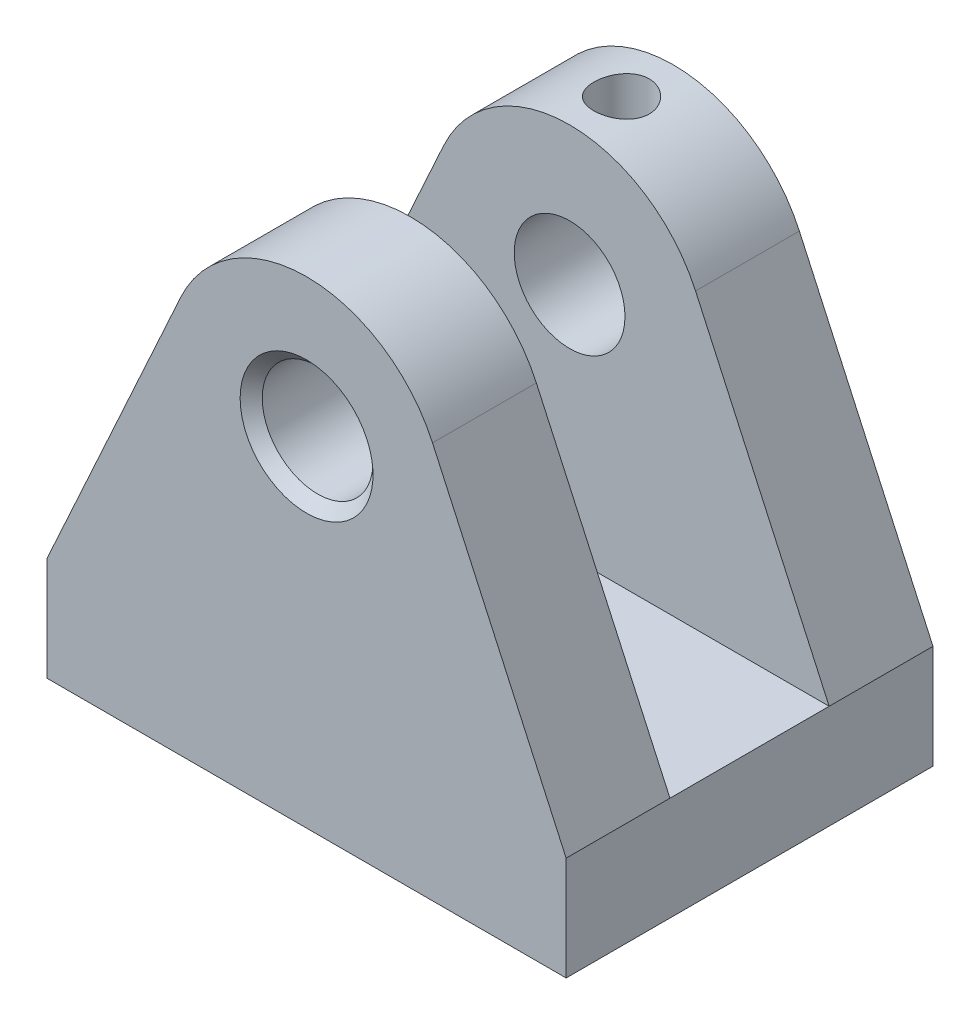
ISO-10303-21;
HEADER;
FILE_DESCRIPTION(('STEP AP214'),'2;1');
FILE_NAME('part.step','',(''),(''),'','','');
FILE_SCHEMA(('AUTOMOTIVE_DESIGN { 1 0 10303 214 1 1 1 1 }'));
ENDSEC;
DATA;
#1=APPLICATION_CONTEXT('core data for automotive mechanical design processes');
#2=APPLICATION_PROTOCOL_DEFINITION('international standard','automotive_design',2000,#1);
#3=PRODUCT_CONTEXT('',#1,'mechanical');
#4=PRODUCT('Part','Part','',(#3));
#5=PRODUCT_RELATED_PRODUCT_CATEGORY('part','',(#4));
#6=PRODUCT_DEFINITION_FORMATION('','',#4);
#7=PRODUCT_DEFINITION_CONTEXT('part definition',#1,'design');
#8=PRODUCT_DEFINITION('design','',#6,#7);
#9=PRODUCT_DEFINITION_SHAPE('','',#8);
#10=(LENGTH_UNIT() NAMED_UNIT(*) SI_UNIT(.MILLI.,.METRE.));
#11=(NAMED_UNIT(*) PLANE_ANGLE_UNIT() SI_UNIT($,.RADIAN.));
#12=(NAMED_UNIT(*) SI_UNIT($,.STERADIAN.) SOLID_ANGLE_UNIT());
#13=UNCERTAINTY_MEASURE_WITH_UNIT(LENGTH_MEASURE(1.E-05),#10,'distance_accuracy_value','');
#14=(GEOMETRIC_REPRESENTATION_CONTEXT(3) GLOBAL_UNCERTAINTY_ASSIGNED_CONTEXT((#13)) GLOBAL_UNIT_ASSIGNED_CONTEXT((#10,
#11,#12)) REPRESENTATION_CONTEXT('',''));
#15=CARTESIAN_POINT('',(0.,0.,0.));
#16=DIRECTION('',(0.,0.,1.));
#17=DIRECTION('',(1.,0.,0.));
#18=AXIS2_PLACEMENT_3D('',#15,#16,#17);
#19=CARTESIAN_POINT('',(-37.5,0.,15.));
#20=DIRECTION('',(-1.,0.,0.));
#21=DIRECTION('',(0.,0.,1.));
#22=AXIS2_PLACEMENT_3D('',#19,#20,#21);
#23=PLANE('',#22);
#24=DIRECTION('',(0.,0.,-1.));
#25=VECTOR('',#24,1.);
#26=CARTESIAN_POINT('',(-37.5,14.9969937199859,15.));
#27=LINE('',#26,#25);
#28=CARTESIAN_POINT('',(-37.5,14.9969937199859,15.));
#29=VERTEX_POINT('',#28);
#30=CARTESIAN_POINT('',(-37.5,14.9969937199859,0.));
#31=VERTEX_POINT('',#30);
#32=EDGE_CURVE('E96',#29,#31,#27,.T.);
#33=ORIENTED_EDGE('',*,*,#32,.T.);
#34=DIRECTION('',(0.,0.,1.));
#35=VECTOR('',#34,1.);
#36=CARTESIAN_POINT('',(-37.5,14.9969937199859,-11.5));
#37=LINE('',#36,#35);
#38=CARTESIAN_POINT('',(-37.5,14.9969937199859,-23.));
#39=VERTEX_POINT('',#38);
#40=EDGE_CURVE('E319',#39,#31,#37,.T.);
#41=ORIENTED_EDGE('',*,*,#40,.F.);
#42=DIRECTION('',(0.,0.,1.));
#43=VECTOR('',#42,1.);
#44=CARTESIAN_POINT('',(-37.5,14.9969937199859,-38.));
#45=LINE('',#44,#43);
#46=CARTESIAN_POINT('',(-37.5,14.9969937199859,-38.));
#47=VERTEX_POINT('',#46);
#48=EDGE_CURVE('E328',#47,#39,#45,.T.);
#49=ORIENTED_EDGE('',*,*,#48,.F.);
#50=DIRECTION('',(0.,1.,0.));
#51=VECTOR('',#50,1.);
#52=CARTESIAN_POINT('',(-37.5,0.,-38.));
#53=LINE('',#52,#51);
#54=CARTESIAN_POINT('',(-37.5,0.,-38.));
#55=VERTEX_POINT('',#54);
#56=EDGE_CURVE('E309',#55,#47,#53,.T.);
#57=ORIENTED_EDGE('',*,*,#56,.F.);
#58=DIRECTION('',(0.,0.,-1.));
#59=VECTOR('',#58,1.);
#60=CARTESIAN_POINT('',(-37.5,0.,15.));
#61=LINE('',#60,#59);
#62=CARTESIAN_POINT('',(-37.5,0.,15.));
#63=VERTEX_POINT('',#62);
#64=EDGE_CURVE('E67',#63,#55,#61,.T.);
#65=ORIENTED_EDGE('',*,*,#64,.F.);
#66=DIRECTION('',(0.,1.,0.));
#67=VECTOR('',#66,1.);
#68=CARTESIAN_POINT('',(-37.5,0.,15.));
#69=LINE('',#68,#67);
#70=EDGE_CURVE('E154',#63,#29,#69,.T.);
#71=ORIENTED_EDGE('',*,*,#70,.T.);
#72=EDGE_LOOP('',(#33,#41,#49,#57,#65,#71));
#73=FACE_BOUND('',#72,.T.);
#74=ADVANCED_FACE('F48',(#73),#23,.T.);
#75=CARTESIAN_POINT('',(-37.5,0.,15.));
#76=DIRECTION('',(0.,1.,0.));
#77=DIRECTION('',(-1.,0.,0.));
#78=AXIS2_PLACEMENT_3D('',#75,#76,#77);
#79=PLANE('',#78);
#80=ORIENTED_EDGE('',*,*,#64,.T.);
#81=DIRECTION('',(1.,0.,0.));
#82=VECTOR('',#81,1.);
#83=CARTESIAN_POINT('',(-37.5,0.,-38.));
#84=LINE('',#83,#82);
#85=CARTESIAN_POINT('',(37.5,0.,-38.));
#86=VERTEX_POINT('',#85);
#87=EDGE_CURVE('E330',#55,#86,#84,.T.);
#88=ORIENTED_EDGE('',*,*,#87,.T.);
#89=DIRECTION('',(0.,0.,-1.));
#90=VECTOR('',#89,1.);
#91=CARTESIAN_POINT('',(37.5,0.,15.));
#92=LINE('',#91,#90);
#93=CARTESIAN_POINT('',(37.5,0.,15.));
#94=VERTEX_POINT('',#93);
#95=EDGE_CURVE('E130',#94,#86,#92,.T.);
#96=ORIENTED_EDGE('',*,*,#95,.F.);
#97=DIRECTION('',(1.,0.,0.));
#98=VECTOR('',#97,1.);
#99=CARTESIAN_POINT('',(-37.5,0.,15.));
#100=LINE('',#99,#98);
#101=EDGE_CURVE('E114',#63,#94,#100,.T.);
#102=ORIENTED_EDGE('',*,*,#101,.F.);
#103=EDGE_LOOP('',(#80,#88,#96,#102));
#104=FACE_BOUND('',#103,.T.);
#105=ADVANCED_FACE('F195',(#104),#79,.F.);
#106=CARTESIAN_POINT('',(37.5,0.,15.));
#107=DIRECTION('',(-1.,0.,0.));
#108=DIRECTION('',(0.,-1.,0.));
#109=AXIS2_PLACEMENT_3D('',#106,#107,#108);
#110=PLANE('',#109);
#111=ORIENTED_EDGE('',*,*,#95,.T.);
#112=DIRECTION('',(0.,1.,0.));
#113=VECTOR('',#112,1.);
#114=CARTESIAN_POINT('',(37.5,0.,-38.));
#115=LINE('',#114,#113);
#116=CARTESIAN_POINT('',(37.5,14.9969937199858,-38.));
#117=VERTEX_POINT('',#116);
#118=EDGE_CURVE('E313',#86,#117,#115,.T.);
#119=ORIENTED_EDGE('',*,*,#118,.T.);
#120=DIRECTION('',(0.,0.,1.));
#121=VECTOR('',#120,1.);
#122=CARTESIAN_POINT('',(37.5,14.9969937199858,-38.));
#123=LINE('',#122,#121);
#124=CARTESIAN_POINT('',(37.5,14.9969937199858,-23.));
#125=VERTEX_POINT('',#124);
#126=EDGE_CURVE('E304',#117,#125,#123,.T.);
#127=ORIENTED_EDGE('',*,*,#126,.T.);
#128=DIRECTION('',(0.,0.,1.));
#129=VECTOR('',#128,1.);
#130=CARTESIAN_POINT('',(37.5,14.9969937199858,-11.5));
#131=LINE('',#130,#129);
#132=CARTESIAN_POINT('',(37.5,14.9969937199858,0.));
#133=VERTEX_POINT('',#132);
#134=EDGE_CURVE('E126',#125,#133,#131,.T.);
#135=ORIENTED_EDGE('',*,*,#134,.T.);
#136=DIRECTION('',(0.,0.,-1.));
#137=VECTOR('',#136,1.);
#138=CARTESIAN_POINT('',(37.5,14.9969937199858,15.));
#139=LINE('',#138,#137);
#140=CARTESIAN_POINT('',(37.5,14.9969937199858,15.));
#141=VERTEX_POINT('',#140);
#142=EDGE_CURVE('E122',#141,#133,#139,.T.);
#143=ORIENTED_EDGE('',*,*,#142,.F.);
#144=DIRECTION('',(0.,1.,0.));
#145=VECTOR('',#144,1.);
#146=CARTESIAN_POINT('',(37.5,0.,15.));
#147=LINE('',#146,#145);
#148=EDGE_CURVE('E107',#94,#141,#147,.T.);
#149=ORIENTED_EDGE('',*,*,#148,.F.);
#150=EDGE_LOOP('',(#111,#119,#127,#135,#143,#149));
#151=FACE_BOUND('',#150,.T.);
#152=ADVANCED_FACE('F123',(#151),#110,.F.);
#153=CARTESIAN_POINT('',(37.5,14.9969937199858,15.));
#154=DIRECTION('',(-0.909747292418773,-0.415162454873646,0.));
#155=DIRECTION('',(0.415162454873646,-0.909747292418773,0.));
#156=AXIS2_PLACEMENT_3D('',#153,#154,#155);
#157=PLANE('',#156);
#158=DIRECTION('',(-0.415162454873646,0.909747292418773,0.));
#159=VECTOR('',#158,1.);
#160=CARTESIAN_POINT('',(37.5,14.9969937199858,0.));
#161=LINE('',#160,#159);
#162=CARTESIAN_POINT('',(18.1949458483755,57.3002428174588,0.));
#163=VERTEX_POINT('',#162);
#164=EDGE_CURVE('E151',#133,#163,#161,.T.);
#165=ORIENTED_EDGE('',*,*,#164,.T.);
#166=DIRECTION('',(0.,0.,-1.));
#167=VECTOR('',#166,1.);
#168=CARTESIAN_POINT('',(18.1949458483755,57.3002428174588,15.));
#169=LINE('',#168,#167);
#170=CARTESIAN_POINT('',(18.1949458483755,57.3002428174588,15.));
#171=VERTEX_POINT('',#170);
#172=EDGE_CURVE('E90',#171,#163,#169,.T.);
#173=ORIENTED_EDGE('',*,*,#172,.F.);
#174=DIRECTION('',(-0.415162454873646,0.909747292418773,0.));
#175=VECTOR('',#174,1.);
#176=CARTESIAN_POINT('',(37.5,14.9969937199858,15.));
#177=LINE('',#176,#175);
#178=EDGE_CURVE('E113',#141,#171,#177,.T.);
#179=ORIENTED_EDGE('',*,*,#178,.F.);
#180=ORIENTED_EDGE('',*,*,#142,.T.);
#181=EDGE_LOOP('',(#165,#173,#179,#180));
#182=FACE_BOUND('',#181,.T.);
#183=ADVANCED_FACE('F132',(#182),#157,.F.);
#184=CARTESIAN_POINT('',(0.,48.9969937199859,15.));
#185=DIRECTION('',(0.,0.,-1.));
#186=DIRECTION('',(-1.,0.,0.));
#187=AXIS2_PLACEMENT_3D('',#184,#185,#186);
#188=CYLINDRICAL_SURFACE('',#187,20.);
#189=CARTESIAN_POINT('',(0.,48.9969937199859,0.));
#190=DIRECTION('',(0.,0.,-1.));
#191=DIRECTION('',(-1.,0.,0.));
#192=AXIS2_PLACEMENT_3D('',#189,#190,#191);
#193=CIRCLE('',#192,20.);
#194=CARTESIAN_POINT('',(-18.1949458483755,57.3002428174588,0.));
#195=VERTEX_POINT('',#194);
#196=EDGE_CURVE('E147',#195,#163,#193,.T.);
#197=ORIENTED_EDGE('',*,*,#196,.F.);
#198=DIRECTION('',(0.,0.,-1.));
#199=VECTOR('',#198,1.);
#200=CARTESIAN_POINT('',(-18.1949458483755,57.3002428174588,15.));
#201=LINE('',#200,#199);
#202=CARTESIAN_POINT('',(-18.1949458483755,57.3002428174588,15.));
#203=VERTEX_POINT('',#202);
#204=EDGE_CURVE('E83',#203,#195,#201,.T.);
#205=ORIENTED_EDGE('',*,*,#204,.F.);
#206=CARTESIAN_POINT('',(0.,48.9969937199859,15.));
#207=DIRECTION('',(0.,0.,-1.));
#208=DIRECTION('',(-1.,0.,0.));
#209=AXIS2_PLACEMENT_3D('',#206,#207,#208);
#210=CIRCLE('',#209,20.);
#211=EDGE_CURVE('E134',#203,#171,#210,.T.);
#212=ORIENTED_EDGE('',*,*,#211,.T.);
#213=ORIENTED_EDGE('',*,*,#172,.T.);
#214=EDGE_LOOP('',(#197,#205,#212,#213));
#215=FACE_BOUND('',#214,.T.);
#216=ADVANCED_FACE('F211',(#215),#188,.T.);
#217=CARTESIAN_POINT('',(-37.5,14.9969937199859,15.));
#218=DIRECTION('',(-0.909747292418773,0.415162454873646,0.));
#219=DIRECTION('',(-0.415162454873646,-0.909747292418773,0.));
#220=AXIS2_PLACEMENT_3D('',#217,#218,#219);
#221=PLANE('',#220);
#222=DIRECTION('',(0.415162454873646,0.909747292418773,0.));
#223=VECTOR('',#222,1.);
#224=CARTESIAN_POINT('',(-37.5,14.9969937199859,0.));
#225=LINE('',#224,#223);
#226=EDGE_CURVE('E143',#31,#195,#225,.T.);
#227=ORIENTED_EDGE('',*,*,#226,.F.);
#228=ORIENTED_EDGE('',*,*,#32,.F.);
#229=DIRECTION('',(0.415162454873646,0.909747292418773,0.));
#230=VECTOR('',#229,1.);
#231=CARTESIAN_POINT('',(-37.5,14.9969937199859,15.));
#232=LINE('',#231,#230);
#233=EDGE_CURVE('E137',#29,#203,#232,.T.);
#234=ORIENTED_EDGE('',*,*,#233,.T.);
#235=ORIENTED_EDGE('',*,*,#204,.T.);
#236=EDGE_LOOP('',(#227,#228,#234,#235));
#237=FACE_BOUND('',#236,.T.);
#238=ADVANCED_FACE('F203',(#237),#221,.T.);
#239=CARTESIAN_POINT('',(0.,48.9969937199859,15.));
#240=DIRECTION('',(0.,0.,-1.));
#241=DIRECTION('',(-1.,0.,0.));
#242=AXIS2_PLACEMENT_3D('',#239,#240,#241);
#243=PLANE('',#242);
#244=CARTESIAN_POINT('',(0.,49.,15.));
#245=DIRECTION('',(0.,0.,-1.));
#246=DIRECTION('',(-1.,0.,0.));
#247=AXIS2_PLACEMENT_3D('',#244,#245,#246);
#248=CIRCLE('',#247,9.6);
#249=CARTESIAN_POINT('',(-9.6,49.,15.));
#250=VERTEX_POINT('',#249);
#251=EDGE_CURVE('E11',#250,#250,#248,.T.);
#252=ORIENTED_EDGE('',*,*,#251,.T.);
#253=EDGE_LOOP('',(#252));
#254=FACE_BOUND('',#253,.T.);
#255=ORIENTED_EDGE('',*,*,#70,.F.);
#256=ORIENTED_EDGE('',*,*,#101,.T.);
#257=ORIENTED_EDGE('',*,*,#148,.T.);
#258=ORIENTED_EDGE('',*,*,#178,.T.);
#259=ORIENTED_EDGE('',*,*,#211,.F.);
#260=ORIENTED_EDGE('',*,*,#233,.F.);
#261=EDGE_LOOP('',(#255,#256,#257,#258,#259,#260));
#262=FACE_BOUND('',#261,.T.);
#263=ADVANCED_FACE('F110',(#254,#262),#243,.F.);
#264=CARTESIAN_POINT('',(0.,48.9969937199859,0.));
#265=DIRECTION('',(0.,0.,-1.));
#266=DIRECTION('',(-1.,0.,0.));
#267=AXIS2_PLACEMENT_3D('',#264,#265,#266);
#268=PLANE('',#267);
#269=CARTESIAN_POINT('',(0.,49.,0.));
#270=DIRECTION('',(0.,0.,-1.));
#271=DIRECTION('',(-1.,0.,0.));
#272=AXIS2_PLACEMENT_3D('',#269,#270,#271);
#273=CIRCLE('',#272,8.);
#274=CARTESIAN_POINT('',(-8.,49.,0.));
#275=VERTEX_POINT('',#274);
#276=EDGE_CURVE('E170',#275,#275,#273,.T.);
#277=ORIENTED_EDGE('',*,*,#276,.F.);
#278=EDGE_LOOP('',(#277));
#279=FACE_BOUND('',#278,.T.);
#280=DIRECTION('',(1.,0.,0.));
#281=VECTOR('',#280,1.);
#282=CARTESIAN_POINT('',(-37.5,14.9969937199859,0.));
#283=LINE('',#282,#281);
#284=EDGE_CURVE('E315',#31,#133,#283,.T.);
#285=ORIENTED_EDGE('',*,*,#284,.F.);
#286=ORIENTED_EDGE('',*,*,#226,.T.);
#287=ORIENTED_EDGE('',*,*,#196,.T.);
#288=ORIENTED_EDGE('',*,*,#164,.F.);
#289=EDGE_LOOP('',(#285,#286,#287,#288));
#290=FACE_BOUND('',#289,.T.);
#291=ADVANCED_FACE('F218',(#279,#290),#268,.T.);
#292=CARTESIAN_POINT('',(-37.5,14.9969937199859,-11.5));
#293=DIRECTION('',(0.,-1.,0.));
#294=DIRECTION('',(1.,0.,0.));
#295=AXIS2_PLACEMENT_3D('',#292,#293,#294);
#296=PLANE('',#295);
#297=ORIENTED_EDGE('',*,*,#284,.T.);
#298=ORIENTED_EDGE('',*,*,#134,.F.);
#299=DIRECTION('',(1.,0.,0.));
#300=VECTOR('',#299,1.);
#301=CARTESIAN_POINT('',(-37.5,14.9969937199859,-23.));
#302=LINE('',#301,#300);
#303=EDGE_CURVE('E287',#39,#125,#302,.T.);
#304=ORIENTED_EDGE('',*,*,#303,.F.);
#305=ORIENTED_EDGE('',*,*,#40,.T.);
#306=EDGE_LOOP('',(#297,#298,#304,#305));
#307=FACE_BOUND('',#306,.T.);
#308=ADVANCED_FACE('F221',(#307),#296,.F.);
#309=CARTESIAN_POINT('',(37.5,14.9969937199858,-38.));
#310=DIRECTION('',(-0.909747292418773,-0.415162454873646,0.));
#311=DIRECTION('',(0.415162454873646,-0.909747292418773,0.));
#312=AXIS2_PLACEMENT_3D('',#309,#310,#311);
#313=PLANE('',#312);
#314=DIRECTION('',(-0.415162454873646,0.909747292418773,0.));
#315=VECTOR('',#314,1.);
#316=CARTESIAN_POINT('',(37.5,14.9969937199858,-23.));
#317=LINE('',#316,#315);
#318=CARTESIAN_POINT('',(18.1949458483755,57.3002428174588,-23.));
#319=VERTEX_POINT('',#318);
#320=EDGE_CURVE('E291',#125,#319,#317,.T.);
#321=ORIENTED_EDGE('',*,*,#320,.F.);
#322=ORIENTED_EDGE('',*,*,#126,.F.);
#323=DIRECTION('',(-0.415162454873646,0.909747292418773,0.));
#324=VECTOR('',#323,1.);
#325=CARTESIAN_POINT('',(37.5,14.9969937199858,-38.));
#326=LINE('',#325,#324);
#327=CARTESIAN_POINT('',(18.1949458483755,57.3002428174588,-38.));
#328=VERTEX_POINT('',#327);
#329=EDGE_CURVE('E368',#117,#328,#326,.T.);
#330=ORIENTED_EDGE('',*,*,#329,.T.);
#331=DIRECTION('',(0.,0.,1.));
#332=VECTOR('',#331,1.);
#333=CARTESIAN_POINT('',(18.1949458483755,57.3002428174588,-38.));
#334=LINE('',#333,#332);
#335=EDGE_CURVE('E307',#328,#319,#334,.T.);
#336=ORIENTED_EDGE('',*,*,#335,.T.);
#337=EDGE_LOOP('',(#321,#322,#330,#336));
#338=FACE_BOUND('',#337,.T.);
#339=ADVANCED_FACE('F228',(#338),#313,.F.);
#340=CARTESIAN_POINT('',(0.,48.9969937199859,-38.));
#341=DIRECTION('',(0.,0.,1.));
#342=DIRECTION('',(-1.,0.,0.));
#343=AXIS2_PLACEMENT_3D('',#340,#341,#342);
#344=CYLINDRICAL_SURFACE('',#343,20.);
#345=CARTESIAN_POINT('',(0.,68.9969937199859,-26.5));
#346=CARTESIAN_POINT('',(-0.222307627170533,68.9969896232207,-26.5000081779934));
#347=CARTESIAN_POINT('',(-0.444718640806089,68.9932491271151,-26.5185953718706));
#348=CARTESIAN_POINT('',(-0.883254030756077,68.9786883449151,-26.592394000461));
#349=CARTESIAN_POINT('',(-1.09937327016542,68.9678624343934,-26.647634531206));
#350=CARTESIAN_POINT('',(-1.51892122105325,68.9403396911172,-26.7929650944831));
#351=CARTESIAN_POINT('',(-1.72236187173253,68.9236484830542,-26.8830217473787));
#352=CARTESIAN_POINT('',(-2.1112319554569,68.8862096413988,-27.0953289900452));
#353=CARTESIAN_POINT('',(-2.29666246030325,68.8654622494157,-27.2175776624289));
#354=CARTESIAN_POINT('',(-2.64677390925946,68.8218803331831,-27.4925539771657));
#355=CARTESIAN_POINT('',(-2.81117580463408,68.7990235401539,-27.6456334215647));
#356=CARTESIAN_POINT('',(-3.11214702643213,68.7539609380952,-27.9771696655669));
#357=CARTESIAN_POINT('',(-3.24871417908175,68.7317551800245,-28.1556284453409));
#358=CARTESIAN_POINT('',(-3.49132701339042,68.6902913924685,-28.534864772047));
#359=CARTESIAN_POINT('',(-3.59708375546325,68.6710620145015,-28.7358305751836));
#360=CARTESIAN_POINT('',(-3.77322266632145,68.6380444424048,-29.1531272760181));
#361=CARTESIAN_POINT('',(-3.84360832974976,68.6242557107712,-29.3694566533921));
#362=CARTESIAN_POINT('',(-3.94610119953993,68.6039059297709,-29.8083374556311));
#363=CARTESIAN_POINT('',(-3.97869799183396,68.5972525231496,-30.0307701765566));
#364=CARTESIAN_POINT('',(-4.00620851090316,68.5916487212896,-30.4780392854418));
#365=CARTESIAN_POINT('',(-4.00112609085425,68.592697538401,-30.7028754252735));
#366=CARTESIAN_POINT('',(-3.9538182924077,68.6022957662071,-31.1449871520847));
#367=CARTESIAN_POINT('',(-3.91215416097574,68.6107318344151,-31.3623256225094));
#368=CARTESIAN_POINT('',(-3.79375153849209,68.6339755663071,-31.7868643066518));
#369=CARTESIAN_POINT('',(-3.71701137240269,68.6487835342758,-31.994064035676));
#370=CARTESIAN_POINT('',(-3.53009913469891,68.6832184600235,-32.3940610468144));
#371=CARTESIAN_POINT('',(-3.41970460492847,68.7028773125397,-32.5867515182767));
#372=CARTESIAN_POINT('',(-3.16877429829071,68.7447784709026,-32.9510833998912));
#373=CARTESIAN_POINT('',(-3.02823505742732,68.7670210735189,-33.1227223874046));
#374=CARTESIAN_POINT('',(-2.71799973824235,68.8120745696459,-33.4433176098277));
#375=CARTESIAN_POINT('',(-2.54782464484979,68.8348884884225,-33.5918102714365));
#376=CARTESIAN_POINT('',(-2.18474009624805,68.8781476685618,-33.8582153852049));
#377=CARTESIAN_POINT('',(-1.99183034951757,68.8985928995447,-33.9761274451743));
#378=CARTESIAN_POINT('',(-1.58823754751569,68.9348613264214,-34.1781100369039));
#379=CARTESIAN_POINT('',(-1.37752727834121,68.9506772739168,-34.2621275745781));
#380=CARTESIAN_POINT('',(-0.944595905794663,68.9758500795002,-34.3934418961543));
#381=CARTESIAN_POINT('',(-0.7223762002898,68.9852077200071,-34.4407431282945));
#382=CARTESIAN_POINT('',(-0.276717622508603,68.9963005946606,-34.4966258151771));
#383=CARTESIAN_POINT('',(-0.0533613133023061,68.9981607060846,-34.5058416781611));
#384=CARTESIAN_POINT('',(0.391699736770854,68.99439579719,-34.4870005642313));
#385=CARTESIAN_POINT('',(0.61340456977517,68.9887711976437,-34.4589456825896));
#386=CARTESIAN_POINT('',(1.04682263978616,68.9707470003066,-34.3668865058242));
#387=CARTESIAN_POINT('',(1.25860779335961,68.9584087761541,-34.3032077260084));
#388=CARTESIAN_POINT('',(1.66849450999867,68.9283358024272,-34.1420640693768));
#389=CARTESIAN_POINT('',(1.86659504655015,68.9106006485549,-34.0445966612927));
#390=CARTESIAN_POINT('',(2.24616469474487,68.8713901813176,-33.8172700373947));
#391=CARTESIAN_POINT('',(2.42740050700875,68.8498717374679,-33.6870288758442));
#392=CARTESIAN_POINT('',(2.76567207647682,68.8055831131812,-33.3983632351709));
#393=CARTESIAN_POINT('',(2.92270523572305,68.7828127987214,-33.2399357344005));
#394=CARTESIAN_POINT('',(3.2105623630967,68.7381658622645,-32.8965065924355));
#395=CARTESIAN_POINT('',(3.34095080979462,68.716308129318,-32.7111370231147));
#396=CARTESIAN_POINT('',(3.56874168020482,68.6763613918336,-32.3207545545733));
#397=CARTESIAN_POINT('',(3.66614542369161,68.6582722365196,-32.1157424417058));
#398=CARTESIAN_POINT('',(3.82460736632784,68.6280633433612,-31.6929270154018));
#399=CARTESIAN_POINT('',(3.8858539991642,68.6159127148733,-31.4751966351587));
#400=CARTESIAN_POINT('',(3.97083460650878,68.5988911916669,-31.0322661860364));
#401=CARTESIAN_POINT('',(3.99457347290045,68.5940193476303,-30.8070670951626));
#402=CARTESIAN_POINT('',(4.00368364346987,68.592159705241,-30.3599645418227));
#403=CARTESIAN_POINT('',(3.98974315228358,68.5950304875579,-30.138075404292));
#404=CARTESIAN_POINT('',(3.92540921640024,68.6080166593704,-29.6998734003799));
#405=CARTESIAN_POINT('',(3.87501606451719,68.6181319906726,-29.4835604892208));
#406=CARTESIAN_POINT('',(3.73951427399582,68.6444042887522,-29.0630891550378));
#407=CARTESIAN_POINT('',(3.65449002686938,68.6605465607391,-28.8589025579903));
#408=CARTESIAN_POINT('',(3.45221857840642,68.6970623189527,-28.4675851170622));
#409=CARTESIAN_POINT('',(3.33496867509953,68.7174361599416,-28.2804557050994));
#410=CARTESIAN_POINT('',(3.06922365914566,68.7605521409149,-27.9251377113987));
#411=CARTESIAN_POINT('',(2.92023154894072,68.7833286363739,-27.7573249389296));
#412=CARTESIAN_POINT('',(2.59625747605256,68.828436994864,-27.4488551778833));
#413=CARTESIAN_POINT('',(2.42126954861334,68.8507687545132,-27.3082044387309));
#414=CARTESIAN_POINT('',(2.04807051635299,68.8927470155047,-27.0566614242142));
#415=CARTESIAN_POINT('',(1.84963553771934,68.9123629687557,-26.9460959868799));
#416=CARTESIAN_POINT('',(1.43666544376294,68.9463987233859,-26.7600555096136));
#417=CARTESIAN_POINT('',(1.22214504345251,68.9608232055305,-26.68454884187));
#418=CARTESIAN_POINT('',(0.839285955695122,68.9800486238007,-26.5853922078211));
#419=CARTESIAN_POINT('',(0.673126656055143,68.9863658463239,-26.553427225169));
#420=CARTESIAN_POINT('',(0.33799810084027,68.9948398855816,-26.5107283505665));
#421=CARTESIAN_POINT('',(0.169028934994477,68.9969968349121,-26.4999937819609));
#422=CARTESIAN_POINT('',(0.,68.9969937199859,-26.5));
#423=B_SPLINE_CURVE_WITH_KNOTS('',3,(#345,#346,#347,#348,#349,#350,#351,#352,#353,#354,#355,
#356,#357,#358,#359,#360,#361,#362,#363,#364,#365,#366,#367,#368,#369,#370,#371,#372,#373,#374,
#375,#376,#377,#378,#379,#380,#381,#382,#383,#384,#385,#386,#387,#388,#389,#390,#391,#392,#393,
#394,#395,#396,#397,#398,#399,#400,#401,#402,#403,#404,#405,#406,#407,#408,#409,#410,#411,#412,
#413,#414,#415,#416,#417,#418,#419,#420,#421,#422),.UNSPECIFIED.,.T.,.F.,(4,2,2,2,2,2,2,2,2,2,2,
2,2,2,2,2,2,2,2,2,2,2,2,2,2,2,2,2,2,2,2,2,2,2,2,2,2,2,4),(0.,0.666304522645034,1.33313860276529,
1.99933494100136,2.66549160892345,3.33973068044874,4.01402238698946,4.6944478002369,
5.3748059746079,6.04624740416218,6.71762017128681,7.37886908028893,8.04014957018699,
8.7058996081815,9.37172619002461,10.0495300996918,10.7273427016306,11.4062109941988,
12.0849970279592,12.7524294270884,13.4198243063525,14.0812181580667,14.7426615686787,
15.4122026413721,16.081815533875,16.7616251432068,17.4414075489765,18.1176152413467,
18.7937347332544,19.4575889027459,20.1214377397421,20.7836784501622,21.4459747033125,
22.1195230496035,22.793226181355,23.4739798670633,24.1541182207385,24.6607510116336,
25.1673676548776),.UNSPECIFIED.);
#424=CARTESIAN_POINT('',(0.,68.9969937199859,-26.5));
#425=VERTEX_POINT('',#424);
#426=EDGE_CURVE('E171',#425,#425,#423,.T.);
#427=ORIENTED_EDGE('',*,*,#426,.T.);
#428=EDGE_LOOP('',(#427));
#429=FACE_BOUND('',#428,.T.);
#430=CARTESIAN_POINT('',(0.,48.9969937199859,-23.));
#431=DIRECTION('',(0.,0.,-1.));
#432=DIRECTION('',(-1.,0.,0.));
#433=AXIS2_PLACEMENT_3D('',#430,#431,#432);
#434=CIRCLE('',#433,20.);
#435=CARTESIAN_POINT('',(-18.1949458483755,57.3002428174588,-23.));
#436=VERTEX_POINT('',#435);
#437=EDGE_CURVE('E310',#436,#319,#434,.T.);
#438=ORIENTED_EDGE('',*,*,#437,.T.);
#439=ORIENTED_EDGE('',*,*,#335,.F.);
#440=CARTESIAN_POINT('',(0.,48.9969937199859,-38.));
#441=DIRECTION('',(0.,0.,-1.));
#442=DIRECTION('',(-1.,0.,0.));
#443=AXIS2_PLACEMENT_3D('',#440,#441,#442);
#444=CIRCLE('',#443,20.);
#445=CARTESIAN_POINT('',(-18.1949458483755,57.3002428174588,-38.));
#446=VERTEX_POINT('',#445);
#447=EDGE_CURVE('E370',#446,#328,#444,.T.);
#448=ORIENTED_EDGE('',*,*,#447,.F.);
#449=DIRECTION('',(0.,0.,1.));
#450=VECTOR('',#449,1.);
#451=CARTESIAN_POINT('',(-18.1949458483755,57.3002428174588,-38.));
#452=LINE('',#451,#450);
#453=EDGE_CURVE('E321',#446,#436,#452,.T.);
#454=ORIENTED_EDGE('',*,*,#453,.T.);
#455=EDGE_LOOP('',(#438,#439,#448,#454));
#456=FACE_BOUND('',#455,.T.);
#457=ADVANCED_FACE('F234',(#429,#456),#344,.T.);
#458=CARTESIAN_POINT('',(-37.5,14.9969937199859,-38.));
#459=DIRECTION('',(-0.909747292418773,0.415162454873646,0.));
#460=DIRECTION('',(-0.415162454873646,-0.909747292418773,0.));
#461=AXIS2_PLACEMENT_3D('',#458,#459,#460);
#462=PLANE('',#461);
#463=DIRECTION('',(0.415162454873646,0.909747292418773,0.));
#464=VECTOR('',#463,1.);
#465=CARTESIAN_POINT('',(-37.5,14.9969937199859,-23.));
#466=LINE('',#465,#464);
#467=EDGE_CURVE('E294',#39,#436,#466,.T.);
#468=ORIENTED_EDGE('',*,*,#467,.T.);
#469=ORIENTED_EDGE('',*,*,#453,.F.);
#470=DIRECTION('',(0.415162454873646,0.909747292418773,0.));
#471=VECTOR('',#470,1.);
#472=CARTESIAN_POINT('',(-37.5,14.9969937199859,-38.));
#473=LINE('',#472,#471);
#474=EDGE_CURVE('E360',#47,#446,#473,.T.);
#475=ORIENTED_EDGE('',*,*,#474,.F.);
#476=ORIENTED_EDGE('',*,*,#48,.T.);
#477=EDGE_LOOP('',(#468,#469,#475,#476));
#478=FACE_BOUND('',#477,.T.);
#479=ADVANCED_FACE('F230',(#478),#462,.T.);
#480=CARTESIAN_POINT('',(0.,48.9969937199859,-38.));
#481=DIRECTION('',(0.,0.,1.));
#482=DIRECTION('',(-1.,0.,0.));
#483=AXIS2_PLACEMENT_3D('',#480,#481,#482);
#484=PLANE('',#483);
#485=CARTESIAN_POINT('',(0.,49.,-38.));
#486=DIRECTION('',(0.,0.,1.));
#487=DIRECTION('',(1.,0.,0.));
#488=AXIS2_PLACEMENT_3D('',#485,#486,#487);
#489=CIRCLE('',#488,9.6);
#490=CARTESIAN_POINT('',(9.6,49.,-38.));
#491=VERTEX_POINT('',#490);
#492=EDGE_CURVE('E157',#491,#491,#489,.T.);
#493=ORIENTED_EDGE('',*,*,#492,.T.);
#494=EDGE_LOOP('',(#493));
#495=FACE_BOUND('',#494,.T.);
#496=ORIENTED_EDGE('',*,*,#56,.T.);
#497=ORIENTED_EDGE('',*,*,#474,.T.);
#498=ORIENTED_EDGE('',*,*,#447,.T.);
#499=ORIENTED_EDGE('',*,*,#329,.F.);
#500=ORIENTED_EDGE('',*,*,#118,.F.);
#501=ORIENTED_EDGE('',*,*,#87,.F.);
#502=EDGE_LOOP('',(#496,#497,#498,#499,#500,#501));
#503=FACE_BOUND('',#502,.T.);
#504=ADVANCED_FACE('F233',(#495,#503),#484,.F.);
#505=CARTESIAN_POINT('',(0.,48.9969937199859,-23.));
#506=DIRECTION('',(0.,0.,1.));
#507=DIRECTION('',(-1.,0.,0.));
#508=AXIS2_PLACEMENT_3D('',#505,#506,#507);
#509=PLANE('',#508);
#510=CARTESIAN_POINT('',(0.,49.,-23.));
#511=DIRECTION('',(0.,0.,1.));
#512=DIRECTION('',(1.,0.,0.));
#513=AXIS2_PLACEMENT_3D('',#510,#511,#512);
#514=CIRCLE('',#513,8.);
#515=CARTESIAN_POINT('',(8.,49.,-23.));
#516=VERTEX_POINT('',#515);
#517=EDGE_CURVE('E166',#516,#516,#514,.T.);
#518=ORIENTED_EDGE('',*,*,#517,.F.);
#519=EDGE_LOOP('',(#518));
#520=FACE_BOUND('',#519,.T.);
#521=ORIENTED_EDGE('',*,*,#303,.T.);
#522=ORIENTED_EDGE('',*,*,#320,.T.);
#523=ORIENTED_EDGE('',*,*,#437,.F.);
#524=ORIENTED_EDGE('',*,*,#467,.F.);
#525=EDGE_LOOP('',(#521,#522,#523,#524));
#526=FACE_BOUND('',#525,.T.);
#527=ADVANCED_FACE('F242',(#520,#526),#509,.T.);
#528=CARTESIAN_POINT('',(0.,49.,-38.));
#529=DIRECTION('',(0.,0.,1.));
#530=DIRECTION('',(1.,0.,0.));
#531=AXIS2_PLACEMENT_3D('',#528,#529,#530);
#532=CYLINDRICAL_SURFACE('',#531,8.);
#533=CARTESIAN_POINT('',(0.,49.,-36.4));
#534=DIRECTION('',(0.,0.,1.));
#535=DIRECTION('',(1.,0.,0.));
#536=AXIS2_PLACEMENT_3D('',#533,#534,#535);
#537=CIRCLE('',#536,8.);
#538=CARTESIAN_POINT('',(8.,49.,-36.4));
#539=VERTEX_POINT('',#538);
#540=EDGE_CURVE('E175',#539,#539,#537,.F.);
#541=ORIENTED_EDGE('',*,*,#540,.T.);
#542=EDGE_LOOP('',(#541));
#543=FACE_BOUND('',#542,.T.);
#544=CARTESIAN_POINT('',(0.,57.,-26.5));
#545=CARTESIAN_POINT('',(-0.105191216468488,56.9999996443219,-26.5000004048478));
#546=CARTESIAN_POINT('',(-0.210389995368428,56.9979202762065,-26.5041544573153));
#547=CARTESIAN_POINT('',(-0.420011249701336,56.9896559715098,-26.5207220780992));
#548=CARTESIAN_POINT('',(-0.524433367425618,56.9834692488774,-26.5331392395695));
#549=CARTESIAN_POINT('',(-0.731828138370604,56.967135976596,-26.5661135146953));
#550=CARTESIAN_POINT('',(-0.834798506711917,56.956983780175,-26.5866822366569));
#551=CARTESIAN_POINT('',(-1.0384152051955,56.9329838224363,-26.6357172075564));
#552=CARTESIAN_POINT('',(-1.1390605669938,56.9191345504317,-26.6641866850641));
#553=CARTESIAN_POINT('',(-1.43561775388138,56.8726597429214,-26.7607482311178));
#554=CARTESIAN_POINT('',(-1.6271962065847,56.8350197647167,-26.8401629808474));
#555=CARTESIAN_POINT('',(-1.99392146995421,56.7498288631885,-27.0262890410876));
#556=CARTESIAN_POINT('',(-2.16906957469774,56.7022787213553,-27.1329981993811));
#557=CARTESIAN_POINT('',(-2.51002321260362,56.5982505678589,-27.3780698225994));
#558=CARTESIAN_POINT('',(-2.67462250306452,56.5414064726227,-27.5179566881943));
#559=CARTESIAN_POINT('',(-2.97911611963431,56.4264003034801,-27.8220751375856));
#560=CARTESIAN_POINT('',(-3.11899161990724,56.3682372629647,-27.9863250990433));
#561=CARTESIAN_POINT('',(-3.38102385527715,56.251951351348,-28.3499789871299));
#562=CARTESIAN_POINT('',(-3.50096528772936,56.1941813882391,-28.5511213042748));
#563=CARTESIAN_POINT('',(-3.65378721735264,56.1170993029098,-28.8679345399543));
#564=CARTESIAN_POINT('',(-3.70022392693971,56.0929942283721,-28.9760946628066));
#565=CARTESIAN_POINT('',(-3.78359067078057,56.0488769021181,-29.1968009710789));
#566=CARTESIAN_POINT('',(-3.82052633371565,56.0288622285868,-29.3093445139221));
#567=CARTESIAN_POINT('',(-3.88251046204454,55.9948044998643,-29.5311942193062));
#568=CARTESIAN_POINT('',(-3.9081340887804,55.9804776446802,-29.6402964191646));
#569=CARTESIAN_POINT('',(-3.95018060072941,55.9567706578859,-29.8607405228202));
#570=CARTESIAN_POINT('',(-3.96660836750271,55.9473879018896,-29.9720812057526));
#571=CARTESIAN_POINT('',(-3.99001913809428,55.9339693349006,-30.1960060934661));
#572=CARTESIAN_POINT('',(-3.99700782997252,55.9299303037677,-30.3085895080884));
#573=CARTESIAN_POINT('',(-4.00144340059851,55.9273702241546,-30.5340004780387));
#574=CARTESIAN_POINT('',(-3.99889118971828,55.9288486492108,-30.646828009047));
#575=CARTESIAN_POINT('',(-3.98516575152016,55.9367503855511,-30.8581643784463));
#576=CARTESIAN_POINT('',(-3.97506329407581,55.9425593104071,-30.9567674395722));
#577=CARTESIAN_POINT('',(-3.94763759493625,55.9581892529457,-31.1526516121663));
#578=CARTESIAN_POINT('',(-3.93031208534669,55.9680115307218,-31.2499322985205));
#579=CARTESIAN_POINT('',(-3.86777248849784,56.0030483520377,-31.5387791329002));
#580=CARTESIAN_POINT('',(-3.81198555026409,56.033839037406,-31.7274954570812));
#581=CARTESIAN_POINT('',(-3.67283599572519,56.1074991750698,-32.0969463327708));
#582=CARTESIAN_POINT('',(-3.58886132884633,56.1506332714376,-32.2773925753482));
#583=CARTESIAN_POINT('',(-3.39616568981264,56.2441365265382,-32.6225301870149));
#584=CARTESIAN_POINT('',(-3.28743360222608,56.2945089313224,-32.7872144320649));
#585=CARTESIAN_POINT('',(-3.03227252755196,56.4045245807348,-33.1180828817046));
#586=CARTESIAN_POINT('',(-2.88281182497071,56.4645334788888,-33.2818095707084));
#587=CARTESIAN_POINT('',(-2.55818830727484,56.5819118658998,-33.5829596065005));
#588=CARTESIAN_POINT('',(-2.38301327894514,56.6392800834431,-33.7203703824745));
#589=CARTESIAN_POINT('',(-2.09944472683198,56.7202760768617,-33.9067530302142));
#590=CARTESIAN_POINT('',(-1.9989679987013,56.7469630486219,-33.9666817597531));
#591=CARTESIAN_POINT('',(-1.79256850112001,56.7973044153227,-34.0777664787766));
#592=CARTESIAN_POINT('',(-1.68664805204876,56.8209600875747,-34.1289261663979));
#593=CARTESIAN_POINT('',(-1.47010242051538,56.8645404295953,-34.2219191223728));
#594=CARTESIAN_POINT('',(-1.35947915341347,56.8844666007823,-34.2637561451325));
#595=CARTESIAN_POINT('',(-1.13432950721217,56.9199922120372,-34.3376199385518));
#596=CARTESIAN_POINT('',(-1.01980357880328,56.9355921498224,-34.3696478377592));
#597=CARTESIAN_POINT('',(-0.797438403015337,56.9608767758562,-34.4212268478551));
#598=CARTESIAN_POINT('',(-0.689830906854572,56.9709443603734,-34.441591597057));
#599=CARTESIAN_POINT('',(-0.472998720376384,56.9867442961584,-34.4734464482425));
#600=CARTESIAN_POINT('',(-0.363774173887725,56.9924770306561,-34.4849373347371));
#601=CARTESIAN_POINT('',(-0.144648447401173,56.999443005483,-34.4988904715445));
#602=CARTESIAN_POINT('',(-0.0347475425961458,57.0006779683969,-34.501356178379));
#603=CARTESIAN_POINT('',(0.184837638972485,56.9986180462075,-34.4972357578899));
#604=CARTESIAN_POINT('',(0.294521925108019,56.9953233615766,-34.4906500311634));
#605=CARTESIAN_POINT('',(0.504259611746535,56.9847273494032,-34.4693764304728));
#606=CARTESIAN_POINT('',(0.60439825926698,56.9777577625709,-34.4553589308956));
#607=CARTESIAN_POINT('',(0.803035609307664,56.9602198356512,-34.4198636003361));
#608=CARTESIAN_POINT('',(0.901533743070584,56.9496502736351,-34.3983832362065));
#609=CARTESIAN_POINT('',(1.19351737727532,56.9128912790572,-34.3230648264001));
#610=CARTESIAN_POINT('',(1.38368108667204,56.8816413313513,-34.2583298594093));
#611=CARTESIAN_POINT('',(1.75558493783058,56.8073689477468,-34.1000018910944));
#612=CARTESIAN_POINT('',(1.93692876519229,56.7640354554011,-34.005636690828));
#613=CARTESIAN_POINT('',(2.28183826656572,56.6697587880021,-33.7915689657403));
#614=CARTESIAN_POINT('',(2.44539632212196,56.6188123739984,-33.6718556473684));
#615=CARTESIAN_POINT('',(2.76706877708067,56.5083308836701,-33.3969668802965));
#616=CARTESIAN_POINT('',(2.92307134240144,56.4484436906162,-33.2394634627409));
#617=CARTESIAN_POINT('',(3.20744226426287,56.3304873585626,-32.9002644347453));
#618=CARTESIAN_POINT('',(3.33579150415337,56.2724195008107,-32.7185522283969));
#619=CARTESIAN_POINT('',(3.50772930633183,56.1902816408744,-32.4260059855779));
#620=CARTESIAN_POINT('',(3.5626157867948,56.1631668405465,-32.3225162415637));
#621=CARTESIAN_POINT('',(3.66334616154282,56.1121781264412,-32.1104815646835));
#622=CARTESIAN_POINT('',(3.70919441458265,56.0883026522142,-32.0019390999048));
#623=CARTESIAN_POINT('',(3.79131200961919,56.0447226210375,-31.7805783546357));
#624=CARTESIAN_POINT('',(3.82758904080802,56.0250147185454,-31.6677635902046));
#625=CARTESIAN_POINT('',(3.89012004539429,55.9905825381999,-31.4386472109285));
#626=CARTESIAN_POINT('',(3.91637557070638,55.9758574887497,-31.3223461389785));
#627=CARTESIAN_POINT('',(3.95643062416587,55.9532102561999,-31.0985878668369));
#628=CARTESIAN_POINT('',(3.97118378192521,55.9447707979206,-30.9913531670916));
#629=CARTESIAN_POINT('',(3.99195118317071,55.9328544146971,-30.7757723297994));
#630=CARTESIAN_POINT('',(3.99796634225491,55.9293769698166,-30.6674263098987));
#631=CARTESIAN_POINT('',(4.00116308319383,55.927532080638,-30.4505925032696));
#632=CARTESIAN_POINT('',(3.99834777004019,55.9291628401807,-30.3421047797767));
#633=CARTESIAN_POINT('',(3.98394653809982,55.9374509348198,-30.1259388528865));
#634=CARTESIAN_POINT('',(3.97236097836303,55.9441080641389,-30.0182606165313));
#635=CARTESIAN_POINT('',(3.92770249100378,55.9695287958286,-29.7181998629587));
#636=CARTESIAN_POINT('',(3.88483285002042,55.9937276014239,-29.5276341326862));
#637=CARTESIAN_POINT('',(3.77270184038046,56.0548368241585,-29.1567314974468));
#638=CARTESIAN_POINT('',(3.70343198216887,56.0917513299357,-28.9763979042961));
#639=CARTESIAN_POINT('',(3.53526338936952,56.1771422527939,-28.617511446486));
#640=CARTESIAN_POINT('',(3.43468670285354,56.22622883384,-28.4398922242383));
#641=CARTESIAN_POINT('',(3.20860173383709,56.3294133274236,-28.102898021723));
#642=CARTESIAN_POINT('',(3.08308048046464,56.3835138393011,-27.9435326014593));
#643=CARTESIAN_POINT('',(2.7928225080539,56.4984914824084,-27.6274370909615));
#644=CARTESIAN_POINT('',(2.625174026051,56.5593932837346,-27.4733800703763));
#645=CARTESIAN_POINT('',(2.26458287075638,56.6751161392954,-27.1949315771871));
#646=CARTESIAN_POINT('',(2.0716266499056,56.729933907444,-27.0705560947579));
#647=CARTESIAN_POINT('',(1.76603106757847,56.8033521051736,-26.9090957505848));
#648=CARTESIAN_POINT('',(1.66100410373828,56.8264336792907,-26.8593063585909));
#649=CARTESIAN_POINT('',(1.44639623629744,56.8689179624278,-26.7688510529985));
#650=CARTESIAN_POINT('',(1.33681760142932,56.8883224780374,-26.728180657302));
#651=CARTESIAN_POINT('',(1.11415600876093,56.9228358726569,-26.656523655566));
#652=CARTESIAN_POINT('',(1.00108129646084,56.9379541140943,-26.6255159286133));
#653=CARTESIAN_POINT('',(0.772189766950843,56.9634769458363,-26.5734899199835));
#654=CARTESIAN_POINT('',(0.656374670304617,56.9738844153045,-26.5524655362276));
#655=CARTESIAN_POINT('',(0.450433316283306,56.987811100438,-26.5244203788013));
#656=CARTESIAN_POINT('',(0.360660623567813,56.9923739242138,-26.515270610824));
#657=CARTESIAN_POINT('',(0.180593821057088,56.9984685684879,-26.5030601636219));
#658=CARTESIAN_POINT('',(0.0902996969389664,57.0000003053261,-26.499999652465));
#659=CARTESIAN_POINT('',(0.,57.,-26.5));
#660=B_SPLINE_CURVE_WITH_KNOTS('',3,(#544,#545,#546,#547,#548,#549,#550,#551,#552,#553,#554,
#555,#556,#557,#558,#559,#560,#561,#562,#563,#564,#565,#566,#567,#568,#569,#570,#571,#572,#573,
#574,#575,#576,#577,#578,#579,#580,#581,#582,#583,#584,#585,#586,#587,#588,#589,#590,#591,#592,
#593,#594,#595,#596,#597,#598,#599,#600,#601,#602,#603,#604,#605,#606,#607,#608,#609,#610,#611,
#612,#613,#614,#615,#616,#617,#618,#619,#620,#621,#622,#623,#624,#625,#626,#627,#628,#629,#630,
#631,#632,#633,#634,#635,#636,#637,#638,#639,#640,#641,#642,#643,#644,#645,#646,#647,#648,#649,
#650,#651,#652,#653,#654,#655,#656,#657,#658,#659),.UNSPECIFIED.,.T.,.F.,(4,2,2,2,2,2,2,2,2,2,2,
2,2,2,2,2,2,2,2,2,2,2,2,2,2,2,2,2,2,2,2,2,2,2,2,2,2,2,2,2,2,2,2,2,2,2,2,2,2,2,2,2,2,2,2,2,2,4),
(0.,0.315484235719912,0.631105747230253,0.947178346952275,1.26338029745354,1.89263632058594,
2.52184274094302,3.18911473348911,3.85689264923289,4.57645675584686,4.93648208726456,
5.29629363598333,5.63476191634051,5.97305035229576,6.31113484191767,6.64918707308226,
6.94669148652859,7.24428938086225,7.83905304157541,8.44767049128776,9.05656173495714,
9.74265853790341,10.4290822684957,10.7886699173095,11.1481055433964,11.5073961555811,
11.8666454155399,12.1961419049363,12.5256092612256,12.8549504227676,13.184277008843,
13.4879760335491,13.791778244799,14.3988188497914,15.0232162256701,15.6478800144877,
16.33388641032,17.0203655291613,17.380682030865,17.7408243397693,18.1006764355618,
18.4604727825931,18.7857371805984,19.1109674938045,19.4360834615763,19.7611861199664,
20.3488209353335,20.9366448769134,21.5639619965908,22.1916061711245,22.8955134356508,
23.5997990605888,23.9548906509477,24.3098073249809,24.6639426811876,25.0178613011449,
25.2886761616556,25.5594984967416),.UNSPECIFIED.);
#661=CARTESIAN_POINT('',(0.,57.,-26.5));
#662=VERTEX_POINT('',#661);
#663=EDGE_CURVE('E261',#662,#662,#660,.T.);
#664=ORIENTED_EDGE('',*,*,#663,.F.);
#665=EDGE_LOOP('',(#664));
#666=FACE_BOUND('',#665,.T.);
#667=ORIENTED_EDGE('',*,*,#517,.T.);
#668=EDGE_LOOP('',(#667));
#669=FACE_BOUND('',#668,.T.);
#670=ADVANCED_FACE('F245',(#543,#666,#669),#532,.F.);
#671=CARTESIAN_POINT('',(0.,49.,13.4));
#672=DIRECTION('',(0.,0.,-1.));
#673=DIRECTION('',(-1.,0.,0.));
#674=AXIS2_PLACEMENT_3D('',#671,#672,#673);
#675=CIRCLE('',#674,8.);
#676=CARTESIAN_POINT('',(-8.,49.,13.4));
#677=VERTEX_POINT('',#676);
#678=EDGE_CURVE('E59',#677,#677,#675,.F.);
#679=ORIENTED_EDGE('',*,*,#678,.T.);
#680=EDGE_LOOP('',(#679));
#681=FACE_BOUND('',#680,.T.);
#682=ORIENTED_EDGE('',*,*,#276,.T.);
#683=EDGE_LOOP('',(#682));
#684=FACE_BOUND('',#683,.T.);
#685=ADVANCED_FACE('F182',(#681,#684),#532,.F.);
#686=CARTESIAN_POINT('',(0.,-0.001000000000001,-30.5));
#687=DIRECTION('',(0.,1.,0.));
#688=DIRECTION('',(0.,0.,1.));
#689=AXIS2_PLACEMENT_3D('',#686,#687,#688);
#690=CYLINDRICAL_SURFACE('',#689,4.);
#691=ORIENTED_EDGE('',*,*,#426,.F.);
#692=EDGE_LOOP('',(#691));
#693=FACE_BOUND('',#692,.T.);
#694=ORIENTED_EDGE('',*,*,#663,.T.);
#695=EDGE_LOOP('',(#694));
#696=FACE_BOUND('',#695,.T.);
#697=ADVANCED_FACE('F191',(#693,#696),#690,.F.);
#698=CARTESIAN_POINT('',(0.,49.,-38.));
#699=DIRECTION('',(0.,0.,-1.));
#700=DIRECTION('',(-1.,0.,0.));
#701=AXIS2_PLACEMENT_3D('',#698,#699,#700);
#702=CONICAL_SURFACE('',#701,9.6,0.785398163397448);
#703=ORIENTED_EDGE('',*,*,#540,.F.);
#704=EDGE_LOOP('',(#703));
#705=FACE_BOUND('',#704,.T.);
#706=ORIENTED_EDGE('',*,*,#492,.F.);
#707=EDGE_LOOP('',(#706));
#708=FACE_BOUND('',#707,.T.);
#709=ADVANCED_FACE('F186',(#705,#708),#702,.F.);
#710=CARTESIAN_POINT('',(0.,49.,13.4));
#711=DIRECTION('',(0.,0.,1.));
#712=DIRECTION('',(1.,0.,0.));
#713=AXIS2_PLACEMENT_3D('',#710,#711,#712);
#714=CONICAL_SURFACE('',#713,8.,0.78539816339745);
#715=ORIENTED_EDGE('',*,*,#251,.F.);
#716=EDGE_LOOP('',(#715));
#717=FACE_BOUND('',#716,.T.);
#718=ORIENTED_EDGE('',*,*,#678,.F.);
#719=EDGE_LOOP('',(#718));
#720=FACE_BOUND('',#719,.T.);
#721=ADVANCED_FACE('F51',(#717,#720),#714,.F.);
#722=CLOSED_SHELL('',(#74,#105,#152,#183,#216,#238,#263,#291,#308,#339,#457,#479,#504,#527,#670,
#685,#697,#709,#721));
#723=MANIFOLD_SOLID_BREP('B2',#722);
#724=ADVANCED_BREP_SHAPE_REPRESENTATION('',(#18,#723),#14);
#725=SHAPE_DEFINITION_REPRESENTATION(#9,#724);
ENDSEC;
END-ISO-10303-21;
